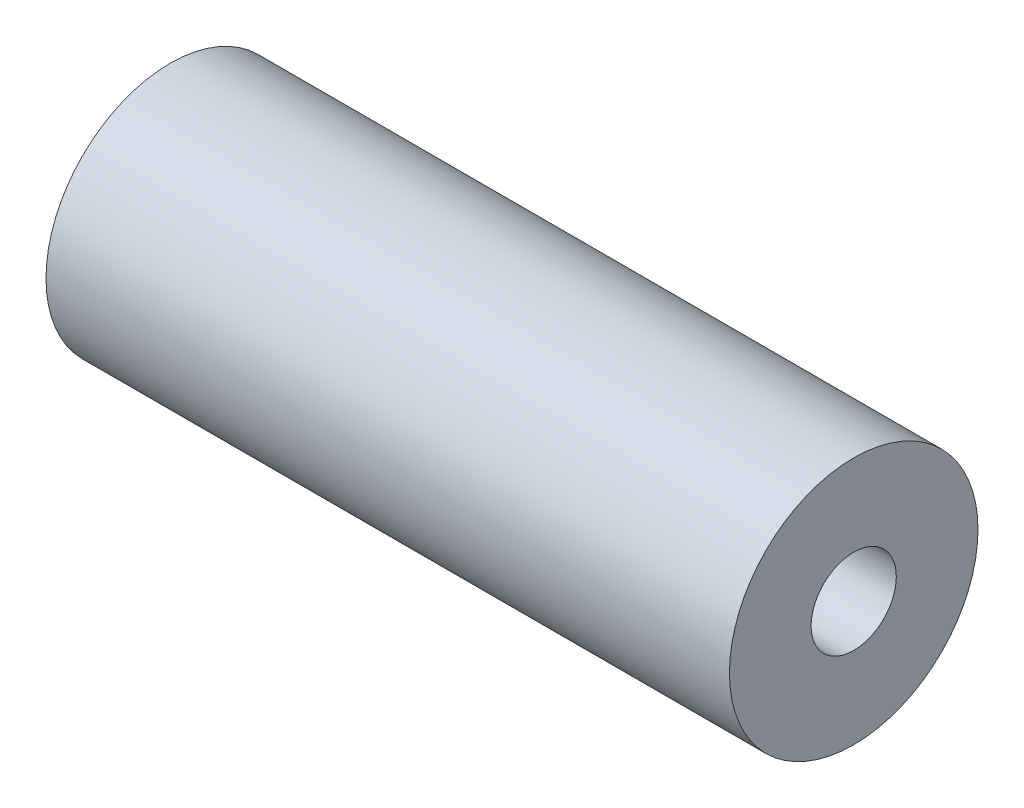
ISO-10303-21;
HEADER;
FILE_DESCRIPTION(('STEP AP214'),'2;1');
FILE_NAME('part.step','',(''),(''),'','','');
FILE_SCHEMA(('AUTOMOTIVE_DESIGN { 1 0 10303 214 1 1 1 1 }'));
ENDSEC;
DATA;
#1=APPLICATION_CONTEXT('core data for automotive mechanical design processes');
#2=APPLICATION_PROTOCOL_DEFINITION('international standard','automotive_design',2000,#1);
#3=PRODUCT_CONTEXT('',#1,'mechanical');
#4=PRODUCT('Part','Part','',(#3));
#5=PRODUCT_RELATED_PRODUCT_CATEGORY('part','',(#4));
#6=PRODUCT_DEFINITION_FORMATION('','',#4);
#7=PRODUCT_DEFINITION_CONTEXT('part definition',#1,'design');
#8=PRODUCT_DEFINITION('design','',#6,#7);
#9=PRODUCT_DEFINITION_SHAPE('','',#8);
#10=(LENGTH_UNIT() NAMED_UNIT(*) SI_UNIT(.MILLI.,.METRE.));
#11=(NAMED_UNIT(*) PLANE_ANGLE_UNIT() SI_UNIT($,.RADIAN.));
#12=(NAMED_UNIT(*) SI_UNIT($,.STERADIAN.) SOLID_ANGLE_UNIT());
#13=UNCERTAINTY_MEASURE_WITH_UNIT(LENGTH_MEASURE(1.E-05),#10,'distance_accuracy_value','');
#14=(GEOMETRIC_REPRESENTATION_CONTEXT(3) GLOBAL_UNCERTAINTY_ASSIGNED_CONTEXT((#13)) GLOBAL_UNIT_ASSIGNED_CONTEXT((#10,
#11,#12)) REPRESENTATION_CONTEXT('',''));
#15=CARTESIAN_POINT('',(0.,0.,0.));
#16=DIRECTION('',(0.,0.,1.));
#17=DIRECTION('',(1.,0.,0.));
#18=AXIS2_PLACEMENT_3D('',#15,#16,#17);
#19=CARTESIAN_POINT('',(52.3875,0.,0.));
#20=DIRECTION('',(1.,0.,0.));
#21=DIRECTION('',(0.,0.,-1.));
#22=AXIS2_PLACEMENT_3D('',#19,#20,#21);
#23=PLANE('',#22);
#24=CARTESIAN_POINT('',(52.3875,0.,0.));
#25=DIRECTION('',(1.,0.,0.));
#26=DIRECTION('',(0.,0.,-1.));
#27=AXIS2_PLACEMENT_3D('',#24,#25,#26);
#28=CIRCLE('',#27,9.525);
#29=CARTESIAN_POINT('',(52.3875,0.,-9.525));
#30=VERTEX_POINT('',#29);
#31=EDGE_CURVE('E10',#30,#30,#28,.T.);
#32=ORIENTED_EDGE('',*,*,#31,.T.);
#33=EDGE_LOOP('',(#32));
#34=FACE_BOUND('',#33,.T.);
#35=CARTESIAN_POINT('',(52.3875,0.,0.));
#36=DIRECTION('',(1.,0.,0.));
#37=DIRECTION('',(0.,0.,-1.));
#38=AXIS2_PLACEMENT_3D('',#35,#36,#37);
#39=CIRCLE('',#38,3.2639);
#40=CARTESIAN_POINT('',(52.3875,0.,-3.2639));
#41=VERTEX_POINT('',#40);
#42=EDGE_CURVE('E50',#41,#41,#39,.T.);
#43=ORIENTED_EDGE('',*,*,#42,.F.);
#44=EDGE_LOOP('',(#43));
#45=FACE_BOUND('',#44,.T.);
#46=ADVANCED_FACE('F37',(#34,#45),#23,.T.);
#47=CARTESIAN_POINT('',(0.,0.,0.));
#48=DIRECTION('',(1.,0.,0.));
#49=DIRECTION('',(0.,0.,-1.));
#50=AXIS2_PLACEMENT_3D('',#47,#48,#49);
#51=PLANE('',#50);
#52=CARTESIAN_POINT('',(0.,0.,0.));
#53=DIRECTION('',(1.,0.,0.));
#54=DIRECTION('',(0.,0.,-1.));
#55=AXIS2_PLACEMENT_3D('',#52,#53,#54);
#56=CIRCLE('',#55,9.525);
#57=CARTESIAN_POINT('',(0.,0.,-9.525));
#58=VERTEX_POINT('',#57);
#59=EDGE_CURVE('E41',#58,#58,#56,.T.);
#60=ORIENTED_EDGE('',*,*,#59,.F.);
#61=EDGE_LOOP('',(#60));
#62=FACE_BOUND('',#61,.T.);
#63=CARTESIAN_POINT('',(0.,0.,0.));
#64=DIRECTION('',(1.,0.,0.));
#65=DIRECTION('',(0.,0.,-1.));
#66=AXIS2_PLACEMENT_3D('',#63,#64,#65);
#67=CIRCLE('',#66,3.2639);
#68=CARTESIAN_POINT('',(0.,0.,-3.2639));
#69=VERTEX_POINT('',#68);
#70=EDGE_CURVE('E52',#69,#69,#67,.T.);
#71=ORIENTED_EDGE('',*,*,#70,.T.);
#72=EDGE_LOOP('',(#71));
#73=FACE_BOUND('',#72,.T.);
#74=ADVANCED_FACE('F64',(#62,#73),#51,.F.);
#75=CARTESIAN_POINT('',(52.3875,0.,0.));
#76=DIRECTION('',(-1.,0.,0.));
#77=DIRECTION('',(0.,0.,1.));
#78=AXIS2_PLACEMENT_3D('',#75,#76,#77);
#79=CYLINDRICAL_SURFACE('',#78,9.525);
#80=ORIENTED_EDGE('',*,*,#31,.F.);
#81=EDGE_LOOP('',(#80));
#82=FACE_BOUND('',#81,.T.);
#83=ORIENTED_EDGE('',*,*,#59,.T.);
#84=EDGE_LOOP('',(#83));
#85=FACE_BOUND('',#84,.T.);
#86=ADVANCED_FACE('F39',(#82,#85),#79,.T.);
#87=CARTESIAN_POINT('',(52.3875,0.,0.));
#88=DIRECTION('',(-1.,0.,0.));
#89=DIRECTION('',(0.,0.,1.));
#90=AXIS2_PLACEMENT_3D('',#87,#88,#89);
#91=CYLINDRICAL_SURFACE('',#90,3.2639);
#92=ORIENTED_EDGE('',*,*,#42,.T.);
#93=EDGE_LOOP('',(#92));
#94=FACE_BOUND('',#93,.T.);
#95=ORIENTED_EDGE('',*,*,#70,.F.);
#96=EDGE_LOOP('',(#95));
#97=FACE_BOUND('',#96,.T.);
#98=ADVANCED_FACE('F60',(#94,#97),#91,.F.);
#99=CLOSED_SHELL('',(#46,#74,#86,#98));
#100=MANIFOLD_SOLID_BREP('B2',#99);
#101=ADVANCED_BREP_SHAPE_REPRESENTATION('',(#18,#100),#14);
#102=SHAPE_DEFINITION_REPRESENTATION(#9,#101);
ENDSEC;
END-ISO-10303-21;
